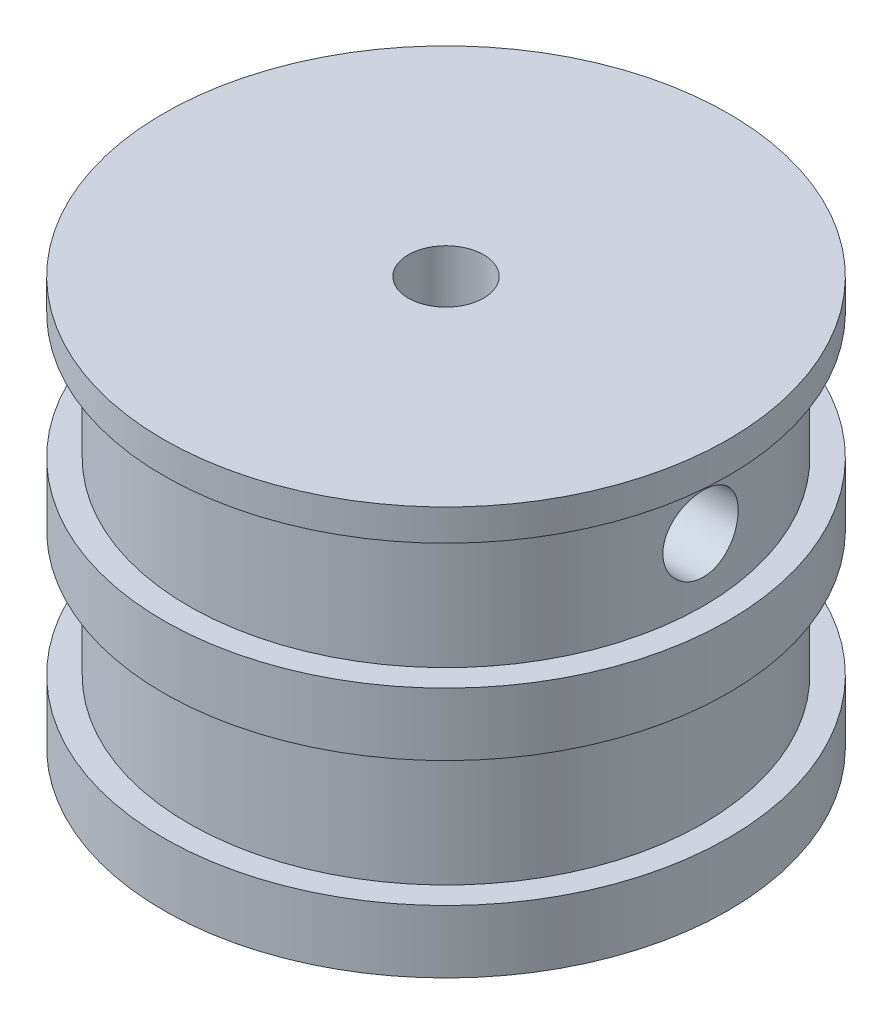
ISO-10303-21;
HEADER;
FILE_DESCRIPTION(('STEP AP214'),'2;1');
FILE_NAME('part.step','',(''),(''),'','','');
FILE_SCHEMA(('AUTOMOTIVE_DESIGN { 1 0 10303 214 1 1 1 1 }'));
ENDSEC;
DATA;
#1=APPLICATION_CONTEXT('core data for automotive mechanical design processes');
#2=APPLICATION_PROTOCOL_DEFINITION('international standard','automotive_design',2000,#1);
#3=PRODUCT_CONTEXT('',#1,'mechanical');
#4=PRODUCT('Part','Part','',(#3));
#5=PRODUCT_RELATED_PRODUCT_CATEGORY('part','',(#4));
#6=PRODUCT_DEFINITION_FORMATION('','',#4);
#7=PRODUCT_DEFINITION_CONTEXT('part definition',#1,'design');
#8=PRODUCT_DEFINITION('design','',#6,#7);
#9=PRODUCT_DEFINITION_SHAPE('','',#8);
#10=(LENGTH_UNIT() NAMED_UNIT(*) SI_UNIT(.MILLI.,.METRE.));
#11=(NAMED_UNIT(*) PLANE_ANGLE_UNIT() SI_UNIT($,.RADIAN.));
#12=(NAMED_UNIT(*) SI_UNIT($,.STERADIAN.) SOLID_ANGLE_UNIT());
#13=UNCERTAINTY_MEASURE_WITH_UNIT(LENGTH_MEASURE(1.E-05),#10,'distance_accuracy_value','');
#14=(GEOMETRIC_REPRESENTATION_CONTEXT(3) GLOBAL_UNCERTAINTY_ASSIGNED_CONTEXT((#13)) GLOBAL_UNIT_ASSIGNED_CONTEXT((#10,
#11,#12)) REPRESENTATION_CONTEXT('',''));
#15=CARTESIAN_POINT('',(0.,0.,0.));
#16=DIRECTION('',(0.,0.,1.));
#17=DIRECTION('',(1.,0.,0.));
#18=AXIS2_PLACEMENT_3D('',#15,#16,#17);
#19=CARTESIAN_POINT('',(-22.5000000000009,52.5000000000004,0.));
#20=DIRECTION('',(1.,0.,0.));
#21=DIRECTION('',(0.,0.,-1.));
#22=AXIS2_PLACEMENT_3D('',#19,#20,#21);
#23=CYLINDRICAL_SURFACE('',#22,3.);
#24=CARTESIAN_POINT('',(20.4999999999986,55.5000000000005,0.));
#25=CARTESIAN_POINT('',(20.4999973607971,55.4999930544588,0.167551274112497));
#26=CARTESIAN_POINT('',(20.4979242926422,55.4859159066347,0.335200951525567));
#27=CARTESIAN_POINT('',(20.4898539115536,55.4299916360493,0.665817543816577));
#28=CARTESIAN_POINT('',(20.4838527341256,55.3881171655627,0.828779682077471));
#29=CARTESIAN_POINT('',(20.4686007945359,55.2778734840935,1.1451883993056));
#30=CARTESIAN_POINT('',(20.4593524469519,55.2095239559297,1.29864194932962));
#31=CARTESIAN_POINT('',(20.4386291513202,55.0483176943781,1.59187723915038));
#32=CARTESIAN_POINT('',(20.4271545239256,54.9554644895839,1.7316609434717));
#33=CARTESIAN_POINT('',(20.403159893681,54.7471491999736,1.99465435493976));
#34=CARTESIAN_POINT('',(20.3906334371134,54.6315406470556,2.11774746913732));
#35=CARTESIAN_POINT('',(20.365997707354,54.381311483183,2.34285986406966));
#36=CARTESIAN_POINT('',(20.3538884577364,54.2466898000788,2.44487795558532));
#37=CARTESIAN_POINT('',(20.3313954798353,53.9614762186892,2.62539534957976));
#38=CARTESIAN_POINT('',(20.3210200899975,53.8108125460588,2.70378237917224));
#39=CARTESIAN_POINT('',(20.3032572917845,53.4982809463103,2.83409512433932));
#40=CARTESIAN_POINT('',(20.2958697284671,53.3364136007001,2.88602221210449));
#41=CARTESIAN_POINT('',(20.284982245701,53.0072934187189,2.96158010934644));
#42=CARTESIAN_POINT('',(20.2814549679223,52.8400872402256,2.9854101406846));
#43=CARTESIAN_POINT('',(20.2786042824561,52.504014961867,3.00471453872235));
#44=CARTESIAN_POINT('',(20.2792806448578,52.3351489532876,3.00019045620103));
#45=CARTESIAN_POINT('',(20.2847357969596,52.0019548276827,2.96307796924888));
#46=CARTESIAN_POINT('',(20.2894822073272,51.8376014330495,2.93071106241699));
#47=CARTESIAN_POINT('',(20.3024920891423,51.5166837553782,2.83917825706707));
#48=CARTESIAN_POINT('',(20.3107556556858,51.3601196830738,2.78001163394208));
#49=CARTESIAN_POINT('',(20.3299046732823,51.0585487802047,2.63632734168323));
#50=CARTESIAN_POINT('',(20.3407998368402,50.9135874742907,2.5517154708059));
#51=CARTESIAN_POINT('',(20.3639773484027,50.6398365894477,2.35960963714994));
#52=CARTESIAN_POINT('',(20.3762597831026,50.5110480222713,2.25211424393063));
#53=CARTESIAN_POINT('',(20.4009711243679,50.2720144235189,2.01607508554962));
#54=CARTESIAN_POINT('',(20.4134003127538,50.1619574613917,1.88734080638919));
#55=CARTESIAN_POINT('',(20.43689606846,49.9649824710016,1.61312853035604));
#56=CARTESIAN_POINT('',(20.4479626303215,49.8780645354338,1.46765046641094));
#57=CARTESIAN_POINT('',(20.4674969996132,49.729826715799,1.16392002425276));
#58=CARTESIAN_POINT('',(20.4759633769796,49.6685209113796,1.00566067672941));
#59=CARTESIAN_POINT('',(20.4893313588076,49.5734088577626,0.68094159323453));
#60=CARTESIAN_POINT('',(20.4942331925442,49.539600839863,0.514482385421752));
#61=CARTESIAN_POINT('',(20.4998895085718,49.5006931289914,0.179712382685182));
#62=CARTESIAN_POINT('',(20.5006813535041,49.4953347983961,0.0114322549735349));
#63=CARTESIAN_POINT('',(20.4981300472779,49.5127926831771,-0.323624059788038));
#64=CARTESIAN_POINT('',(20.4947870177863,49.5356080695539,-0.490400290944024));
#65=CARTESIAN_POINT('',(20.4843647103444,49.6085506989967,-0.816934415549132));
#66=CARTESIAN_POINT('',(20.4773026170258,49.658552356989,-0.976720958248136));
#67=CARTESIAN_POINT('',(20.4602316494574,49.7843160256686,-1.28564244930156));
#68=CARTESIAN_POINT('',(20.4502226426372,49.8600791952922,-1.43477691808455));
#69=CARTESIAN_POINT('',(20.4282777447206,50.035825007349,-1.71930098754809));
#70=CARTESIAN_POINT('',(20.4163289522248,50.1359722250388,-1.85458791963713));
#71=CARTESIAN_POINT('',(20.3918757523167,50.3574136143591,-2.10652667196152));
#72=CARTESIAN_POINT('',(20.3793713142775,50.4787089527425,-2.22317746335059));
#73=CARTESIAN_POINT('',(20.3550981721652,50.7401530112004,-2.43547007233668));
#74=CARTESIAN_POINT('',(20.3433360538285,50.8804429765506,-2.53093880939075));
#75=CARTESIAN_POINT('',(20.3219946608972,51.17521972797,-2.69695540248555));
#76=CARTESIAN_POINT('',(20.3124153295892,51.3297061450389,-2.76750390603306));
#77=CARTESIAN_POINT('',(20.2965713903983,51.6479677463096,-2.88140726833885));
#78=CARTESIAN_POINT('',(20.2902955674517,51.8117093854329,-2.9248542281834));
#79=CARTESIAN_POINT('',(20.2817390414568,52.1442636784943,-2.98361492696057));
#80=CARTESIAN_POINT('',(20.2794580769339,52.3130759998065,-2.99893050717303));
#81=CARTESIAN_POINT('',(20.2791589660791,52.649255114378,-3.00095145966441));
#82=CARTESIAN_POINT('',(20.2811002782945,52.8166202996279,-2.98792892817569));
#83=CARTESIAN_POINT('',(20.288939025127,53.1467534747823,-2.93422532266822));
#84=CARTESIAN_POINT('',(20.2948364545988,53.3095214706654,-2.89354428462109));
#85=CARTESIAN_POINT('',(20.3099090269137,53.6257706508424,-2.78577296430281));
#86=CARTESIAN_POINT('',(20.3190819228671,53.7792581171616,-2.71870078250079));
#87=CARTESIAN_POINT('',(20.3396747456542,54.0728452808866,-2.56007807316655));
#88=CARTESIAN_POINT('',(20.3510947411507,54.2129445690053,-2.46852679761386));
#89=CARTESIAN_POINT('',(20.3750257118914,54.4771623600463,-2.26255269742272));
#90=CARTESIAN_POINT('',(20.3875457198717,54.6011227751178,-2.1479281096326));
#91=CARTESIAN_POINT('',(20.4121899227908,54.8281467500436,-1.89948729697266));
#92=CARTESIAN_POINT('',(20.4243140248746,54.931205436761,-1.76566660901242));
#93=CARTESIAN_POINT('',(20.4468724483858,55.1139788232115,-1.48181189622495));
#94=CARTESIAN_POINT('',(20.4572976074895,55.1935687071451,-1.33169679196189));
#95=CARTESIAN_POINT('',(20.4751933643112,55.3262879066024,-1.02014994145281));
#96=CARTESIAN_POINT('',(20.4826670442254,55.3794448408755,-0.858730209076419));
#97=CARTESIAN_POINT('',(20.4920965960281,55.4456243806654,-0.580473421119607));
#98=CARTESIAN_POINT('',(20.4950452757186,55.4659843726089,-0.465360266997957));
#99=CARTESIAN_POINT('',(20.4989978862223,55.4931745246563,-0.233513997205091));
#100=CARTESIAN_POINT('',(20.5000018394853,55.5000048409461,-0.116780900250098));
#101=CARTESIAN_POINT('',(20.4999999999986,55.5000000000005,0.));
#102=B_SPLINE_CURVE_WITH_KNOTS('',3,(#24,#25,#26,#27,#28,#29,#30,#31,#32,#33,#34,#35,#36,#37,
#38,#39,#40,#41,#42,#43,#44,#45,#46,#47,#48,#49,#50,#51,#52,#53,#54,#55,#56,#57,#58,#59,#60,#61,
#62,#63,#64,#65,#66,#67,#68,#69,#70,#71,#72,#73,#74,#75,#76,#77,#78,#79,#80,#81,#82,#83,#84,#85,
#86,#87,#88,#89,#90,#91,#92,#93,#94,#95,#96,#97,#98,#99,#100,#101),.UNSPECIFIED.,.T.,.F.,(4,2,2,
2,2,2,2,2,2,2,2,2,2,2,2,2,2,2,2,2,2,2,2,2,2,2,2,2,2,2,2,2,2,2,2,2,2,2,4),(0.,0.502227119214347,
1.00494907620881,1.50729800088738,2.00957462543936,2.5151966830633,3.02084726408613,
3.52886368058522,4.03685374909387,4.54121983512863,5.04555833597567,5.54592139785699,
6.04629798929193,6.5485503370542,7.05083408965239,7.55789630191072,8.06496054543308,
8.57230316959597,9.07961315808518,9.58230316735355,10.0849783855378,10.5853510190587,
11.0857461658821,11.5896171035691,12.0935158488768,12.6013916339521,13.1092542218314,
13.6153813649429,14.1214753793941,14.6227314497871,15.1239868682663,15.6248990963324,
16.125826632785,16.6313412811106,17.136973652589,17.6452485723026,18.1529912937422,
18.5030406293488,18.8530859239759),.UNSPECIFIED.);
#103=CARTESIAN_POINT('',(20.4999999999986,55.5000000000005,0.));
#104=VERTEX_POINT('',#103);
#105=EDGE_CURVE('E74',#104,#104,#102,.T.);
#106=ORIENTED_EDGE('',*,*,#105,.T.);
#107=EDGE_LOOP('',(#106));
#108=FACE_BOUND('',#107,.T.);
#109=CARTESIAN_POINT('',(0.,52.5000000000004,0.));
#110=DIRECTION('',(0.707106781186547,-0.707106781186547,0.));
#111=DIRECTION('',(0.707106781186547,0.707106781186547,0.));
#112=AXIS2_PLACEMENT_3D('',#109,#110,#111);
#113=ELLIPSE('',#112,4.24264068711929,3.);
#114=CARTESIAN_POINT('',(0.,52.5000000000004,3.));
#115=VERTEX_POINT('',#114);
#116=CARTESIAN_POINT('',(0.,52.5000000000004,-3.));
#117=VERTEX_POINT('',#116);
#118=EDGE_CURVE('E53',#115,#117,#113,.F.);
#119=ORIENTED_EDGE('',*,*,#118,.T.);
#120=CARTESIAN_POINT('',(0.,52.5000000000004,0.));
#121=DIRECTION('',(0.707106781186547,0.707106781186547,0.));
#122=DIRECTION('',(0.707106781186547,-0.707106781186547,0.));
#123=AXIS2_PLACEMENT_3D('',#120,#121,#122);
#124=ELLIPSE('',#123,4.24264068711929,3.);
#125=EDGE_CURVE('E11',#117,#115,#124,.F.);
#126=ORIENTED_EDGE('',*,*,#125,.T.);
#127=EDGE_LOOP('',(#119,#126));
#128=FACE_BOUND('',#127,.T.);
#129=ADVANCED_FACE('F39',(#108,#128),#23,.F.);
#130=CARTESIAN_POINT('',(0.,60.,0.));
#131=DIRECTION('',(0.,-1.,0.));
#132=DIRECTION('',(0.,0.,-1.));
#133=AXIS2_PLACEMENT_3D('',#130,#131,#132);
#134=CYLINDRICAL_SURFACE('',#133,22.5);
#135=CARTESIAN_POINT('',(-1.196959198424E-12,57.5000000000005,0.));
#136=DIRECTION('',(0.,-1.,0.));
#137=DIRECTION('',(1.,0.,0.));
#138=AXIS2_PLACEMENT_3D('',#135,#136,#137);
#139=CIRCLE('',#138,22.4999999999997);
#140=CARTESIAN_POINT('',(22.4999999999985,57.5000000000009,0.));
#141=VERTEX_POINT('',#140);
#142=EDGE_CURVE('E135',#141,#141,#139,.T.);
#143=ORIENTED_EDGE('',*,*,#142,.F.);
#144=EDGE_LOOP('',(#143));
#145=FACE_BOUND('',#144,.T.);
#146=CARTESIAN_POINT('',(0.,60.,0.));
#147=DIRECTION('',(0.,1.,0.));
#148=DIRECTION('',(0.,0.,1.));
#149=AXIS2_PLACEMENT_3D('',#146,#147,#148);
#150=CIRCLE('',#149,22.5);
#151=CARTESIAN_POINT('',(0.,60.,22.5));
#152=VERTEX_POINT('',#151);
#153=EDGE_CURVE('E68',#152,#152,#150,.T.);
#154=ORIENTED_EDGE('',*,*,#153,.F.);
#155=EDGE_LOOP('',(#154));
#156=FACE_BOUND('',#155,.T.);
#157=ADVANCED_FACE('F41',(#145,#156),#134,.T.);
#158=CARTESIAN_POINT('',(0.,60.,0.));
#159=DIRECTION('',(0.,1.,0.));
#160=DIRECTION('',(0.,0.,1.));
#161=AXIS2_PLACEMENT_3D('',#158,#159,#160);
#162=PLANE('',#161);
#163=CARTESIAN_POINT('',(0.,60.,0.));
#164=DIRECTION('',(0.,1.,0.));
#165=DIRECTION('',(0.,0.,1.));
#166=AXIS2_PLACEMENT_3D('',#163,#164,#165);
#167=CIRCLE('',#166,3.);
#168=CARTESIAN_POINT('',(0.,60.,3.));
#169=VERTEX_POINT('',#168);
#170=EDGE_CURVE('E304',#169,#169,#167,.T.);
#171=ORIENTED_EDGE('',*,*,#170,.F.);
#172=EDGE_LOOP('',(#171));
#173=FACE_BOUND('',#172,.T.);
#174=ORIENTED_EDGE('',*,*,#153,.T.);
#175=EDGE_LOOP('',(#174));
#176=FACE_BOUND('',#175,.T.);
#177=ADVANCED_FACE('F109',(#173,#176),#162,.T.);
#178=CARTESIAN_POINT('',(-7.97972798949342E-13,57.5000000000005,0.));
#179=DIRECTION('',(0.,1.,0.));
#180=DIRECTION('',(-1.,0.,0.));
#181=AXIS2_PLACEMENT_3D('',#178,#179,#180);
#182=PLANE('',#181);
#183=CARTESIAN_POINT('',(-1.196959198424E-12,57.5000000000005,0.));
#184=DIRECTION('',(0.,-1.,0.));
#185=DIRECTION('',(1.,0.,0.));
#186=AXIS2_PLACEMENT_3D('',#183,#184,#185);
#187=CIRCLE('',#186,20.4999999999997);
#188=CARTESIAN_POINT('',(20.4999999999985,57.5000000000009,0.));
#189=VERTEX_POINT('',#188);
#190=EDGE_CURVE('E124',#189,#189,#187,.T.);
#191=ORIENTED_EDGE('',*,*,#190,.F.);
#192=EDGE_LOOP('',(#191));
#193=FACE_BOUND('',#192,.T.);
#194=ORIENTED_EDGE('',*,*,#142,.T.);
#195=EDGE_LOOP('',(#194));
#196=FACE_BOUND('',#195,.T.);
#197=ADVANCED_FACE('F167',(#193,#196),#182,.F.);
#198=CARTESIAN_POINT('',(-4.94396190653399E-13,47.5000000000005,0.));
#199=DIRECTION('',(0.,1.,0.));
#200=DIRECTION('',(-1.,0.,0.));
#201=AXIS2_PLACEMENT_3D('',#198,#199,#200);
#202=PLANE('',#201);
#203=CARTESIAN_POINT('',(-9.88792381306785E-13,47.5000000000004,0.));
#204=DIRECTION('',(0.,-1.,0.));
#205=DIRECTION('',(1.,0.,0.));
#206=AXIS2_PLACEMENT_3D('',#203,#204,#205);
#207=CIRCLE('',#206,20.4999999999998);
#208=CARTESIAN_POINT('',(20.4999999999988,47.5000000000009,0.));
#209=VERTEX_POINT('',#208);
#210=EDGE_CURVE('E127',#209,#209,#207,.T.);
#211=ORIENTED_EDGE('',*,*,#210,.T.);
#212=EDGE_LOOP('',(#211));
#213=FACE_BOUND('',#212,.T.);
#214=CARTESIAN_POINT('',(-9.88792381306786E-13,47.5000000000005,0.));
#215=DIRECTION('',(0.,-1.,0.));
#216=DIRECTION('',(1.,0.,0.));
#217=AXIS2_PLACEMENT_3D('',#214,#215,#216);
#218=CIRCLE('',#217,22.4999999999998);
#219=CARTESIAN_POINT('',(22.4999999999988,47.5000000000009,0.));
#220=VERTEX_POINT('',#219);
#221=EDGE_CURVE('E130',#220,#220,#218,.T.);
#222=ORIENTED_EDGE('',*,*,#221,.F.);
#223=EDGE_LOOP('',(#222));
#224=FACE_BOUND('',#223,.T.);
#225=ADVANCED_FACE('F117',(#213,#224),#202,.T.);
#226=CARTESIAN_POINT('',(0.,0.,0.));
#227=DIRECTION('',(0.,-1.,0.));
#228=DIRECTION('',(1.,0.,0.));
#229=AXIS2_PLACEMENT_3D('',#226,#227,#228);
#230=CYLINDRICAL_SURFACE('',#229,20.4999999999998);
#231=ORIENTED_EDGE('',*,*,#105,.F.);
#232=EDGE_LOOP('',(#231));
#233=FACE_BOUND('',#232,.T.);
#234=CARTESIAN_POINT('',(-20.2792997906741,52.5000000000004,-3.));
#235=CARTESIAN_POINT('',(-20.2793025374249,52.3324595555566,-2.9999930451477));
#236=CARTESIAN_POINT('',(-20.2813984893178,52.1648206782778,-2.98591765559669));
#237=CARTESIAN_POINT('',(-20.2895505551082,51.8342265214094,-2.93000100285925));
#238=CARTESIAN_POINT('',(-20.2956105749968,51.6712760270192,-2.88813235300425));
#239=CARTESIAN_POINT('',(-20.3109900322092,51.3548919454942,-2.77790569452807));
#240=CARTESIAN_POINT('',(-20.3203070132379,51.2014512887273,-2.70956764409246));
#241=CARTESIAN_POINT('',(-20.3411476830147,50.9082376551019,-2.54838842240747));
#242=CARTESIAN_POINT('',(-20.3526710564038,50.7684627293122,-2.45555075216513));
#243=CARTESIAN_POINT('',(-20.3767243901964,50.5054596226084,-2.24725124602923));
#244=CARTESIAN_POINT('',(-20.3892606782698,50.3823507640883,-2.13163946345857));
#245=CARTESIAN_POINT('',(-20.4138707793482,50.1572079200838,-1.88139720074456));
#246=CARTESIAN_POINT('',(-20.4259445672891,50.0551750754577,-1.74676569171496));
#247=CARTESIAN_POINT('',(-20.4483352874299,49.8746420806121,-1.4615432855519));
#248=CARTESIAN_POINT('',(-20.4586439435692,49.7962515411568,-1.31088230466998));
#249=CARTESIAN_POINT('',(-20.4762728870684,49.6659315674554,-0.998356547815582));
#250=CARTESIAN_POINT('',(-20.4835933248805,49.6140008009689,-0.836492336388062));
#251=CARTESIAN_POINT('',(-20.4943763862813,49.5384354721371,-0.507382631213983));
#252=CARTESIAN_POINT('',(-20.4978662144792,49.514601279972,-0.340183879263832));
#253=CARTESIAN_POINT('',(-20.5006880352203,49.4952859861411,-0.00412620717143882));
#254=CARTESIAN_POINT('',(-20.5000202482851,49.4998033806951,0.164732624445155));
#255=CARTESIAN_POINT('',(-20.4946238594462,49.5369051042037,0.497955774785673));
#256=CARTESIAN_POINT('',(-20.4899263302952,49.5692746748762,0.662344579666539));
#257=CARTESIAN_POINT('',(-20.4770329125101,49.6608250142455,0.983331695494815));
#258=CARTESIAN_POINT('',(-20.4688369373911,49.7200064457586,1.13992981374236));
#259=CARTESIAN_POINT('',(-20.4498140707837,49.8637217532158,1.44154266345555));
#260=CARTESIAN_POINT('',(-20.4389777828711,49.9483464347624,1.58651351027327));
#261=CARTESIAN_POINT('',(-20.4158827327488,50.1404798015049,1.86027807943482));
#262=CARTESIAN_POINT('',(-20.4036238813759,50.247989921465,1.98907078671201));
#263=CARTESIAN_POINT('',(-20.3789161345984,50.4840397485025,2.2280884080107));
#264=CARTESIAN_POINT('',(-20.366466534447,50.6127669083558,2.33812820566431));
#265=CARTESIAN_POINT('',(-20.3428925923074,50.886958746885,2.53507192478547));
#266=CARTESIAN_POINT('',(-20.3317682577531,51.0324235194382,2.62197571647963));
#267=CARTESIAN_POINT('',(-20.3121046612565,51.3361499047381,2.77020326673648));
#268=CARTESIAN_POINT('',(-20.3035672564175,51.494420607813,2.83150866061675));
#269=CARTESIAN_POINT('',(-20.2900775102157,51.8191644408267,2.9266164346217));
#270=CARTESIAN_POINT('',(-20.2851249289539,51.9856370210934,2.96042065516435));
#271=CARTESIAN_POINT('',(-20.2794108473386,52.32041395821,2.99931400125128));
#272=CARTESIAN_POINT('',(-20.2786110918468,52.4886872333925,3.00466524192489));
#273=CARTESIAN_POINT('',(-20.2811917114474,52.8237281574074,2.98719562292122));
#274=CARTESIAN_POINT('',(-20.284571963294,52.9904958504854,2.96437559386258));
#275=CARTESIAN_POINT('',(-20.2950966249532,53.3169838367997,2.8914332717428));
#276=CARTESIAN_POINT('',(-20.3022231051744,53.4767338044523,2.84144098775254));
#277=CARTESIAN_POINT('',(-20.319422506211,53.7855862754558,2.71570826850896));
#278=CARTESIAN_POINT('',(-20.3294955660604,53.9346882759707,2.63996661824804));
#279=CARTESIAN_POINT('',(-20.3515435160627,54.2191890606518,2.46425312413682));
#280=CARTESIAN_POINT('',(-20.3635315387173,54.3544817993608,2.36411125627528));
#281=CARTESIAN_POINT('',(-20.3880188599861,54.6064347467902,2.14267696980532));
#282=CARTESIAN_POINT('',(-20.4005181860474,54.7230939535983,2.02138341461787));
#283=CARTESIAN_POINT('',(-20.4247390023745,54.9354064139614,1.75993593738027));
#284=CARTESIAN_POINT('',(-20.4364535569195,55.0308861883164,1.61964040191008));
#285=CARTESIAN_POINT('',(-20.457677804133,55.1969221253421,1.32484940717094));
#286=CARTESIAN_POINT('',(-20.4671875547288,55.2674789428436,1.17035432111821));
#287=CARTESIAN_POINT('',(-20.4829002564539,55.3813874603385,0.852096847895966));
#288=CARTESIAN_POINT('',(-20.4891148279205,55.424834857928,0.688369310015701));
#289=CARTESIAN_POINT('',(-20.4975856577859,55.4836012043028,0.355844891686859));
#290=CARTESIAN_POINT('',(-20.4998421644781,55.4989219175064,0.187048329899015));
#291=CARTESIAN_POINT('',(-20.5001403382026,55.5009585207821,-0.149138318359184));
#292=CARTESIAN_POINT('',(-20.4982211633606,55.4879401644682,-0.316526821106137));
#293=CARTESIAN_POINT('',(-20.4904623875661,55.4342367356885,-0.646707710701838));
#294=CARTESIAN_POINT('',(-20.4846227974223,55.3935517394995,-0.809500110220745));
#295=CARTESIAN_POINT('',(-20.4696762551726,55.2857625603777,-1.12580066539818));
#296=CARTESIAN_POINT('',(-20.4605714706756,55.2186759013955,-1.27931490157632));
#297=CARTESIAN_POINT('',(-20.4400958485142,55.0600159008027,-1.57294961238444));
#298=CARTESIAN_POINT('',(-20.428724944449,54.9684418416456,-1.71306969436639));
#299=CARTESIAN_POINT('',(-20.4048551135872,54.7624418679594,-1.9772882211517));
#300=CARTESIAN_POINT('',(-20.3923470317422,54.6478194509205,-2.10123264758933));
#301=CARTESIAN_POINT('',(-20.3676812025677,54.3993896669269,-2.32822537305069));
#302=CARTESIAN_POINT('',(-20.3555235382336,54.2655777991253,-2.43126875604844));
#303=CARTESIAN_POINT('',(-20.3328656465546,53.9817310586409,-2.61402470169434));
#304=CARTESIAN_POINT('',(-20.32237460167,53.8316134944876,-2.69360994359625));
#305=CARTESIAN_POINT('',(-20.3043453693686,53.5200616081924,-2.82631979377878));
#306=CARTESIAN_POINT('',(-20.2968040960161,53.358639322252,-2.87947207108455));
#307=CARTESIAN_POINT('',(-20.2872846705125,53.0803948341722,-2.94563919196652));
#308=CARTESIAN_POINT('',(-20.284306062306,52.9652973958654,-2.96599360507699));
#309=CARTESIAN_POINT('',(-20.280312677028,52.7334825623705,-2.99317635138331));
#310=CARTESIAN_POINT('',(-20.279297876361,52.6167651866632,-3.00000484709606));
#311=CARTESIAN_POINT('',(-20.2792997906741,52.5000000000004,-3.));
#312=B_SPLINE_CURVE_WITH_KNOTS('',3,(#234,#235,#236,#237,#238,#239,#240,#241,#242,#243,#244,
#245,#246,#247,#248,#249,#250,#251,#252,#253,#254,#255,#256,#257,#258,#259,#260,#261,#262,#263,
#264,#265,#266,#267,#268,#269,#270,#271,#272,#273,#274,#275,#276,#277,#278,#279,#280,#281,#282,
#283,#284,#285,#286,#287,#288,#289,#290,#291,#292,#293,#294,#295,#296,#297,#298,#299,#300,#301,
#302,#303,#304,#305,#306,#307,#308,#309,#310,#311),.UNSPECIFIED.,.T.,.F.,(4,2,2,2,2,2,2,2,2,2,2,
2,2,2,2,2,2,2,2,2,2,2,2,2,2,2,2,2,2,2,2,2,2,2,2,2,2,2,4),(0.,0.502194580870726,1.00488474565248,
1.50719661270946,2.0094367380002,2.5151013877544,3.02079340229577,3.52879509416412,
4.03677120579611,4.54111590046983,5.04543384471399,5.54589766660697,6.04637386114647,
6.5486578698005,7.05097337758555,7.55799147665511,8.06501241960656,8.57239648476493,
9.07974659226004,9.58241467674425,10.0850679406146,10.5853371004693,11.0856298692629,
11.5895137864723,12.0934247880679,12.6013222320974,13.109206330536,13.6152872764613,
14.1213364742786,14.6226605829159,15.1239833094092,15.6249738455433,16.1259790636539,
16.6314520719235,17.137043832366,17.6453312273109,18.1530854404514,18.5030877861088,
18.8530859263849),.UNSPECIFIED.);
#313=CARTESIAN_POINT('',(-20.2792997906741,52.5000000000004,-3.));
#314=VERTEX_POINT('',#313);
#315=EDGE_CURVE('E84',#314,#314,#312,.T.);
#316=ORIENTED_EDGE('',*,*,#315,.F.);
#317=EDGE_LOOP('',(#316));
#318=FACE_BOUND('',#317,.T.);
#319=ORIENTED_EDGE('',*,*,#190,.T.);
#320=EDGE_LOOP('',(#319));
#321=FACE_BOUND('',#320,.T.);
#322=ORIENTED_EDGE('',*,*,#210,.F.);
#323=EDGE_LOOP('',(#322));
#324=FACE_BOUND('',#323,.T.);
#325=ADVANCED_FACE('F89',(#233,#318,#321,#324),#230,.T.);
#326=CARTESIAN_POINT('',(-8.84708972748178E-13,42.5000000000005,0.));
#327=DIRECTION('',(0.,-1.,0.));
#328=DIRECTION('',(1.,0.,0.));
#329=AXIS2_PLACEMENT_3D('',#326,#327,#328);
#330=CIRCLE('',#329,22.4999999999999);
#331=CARTESIAN_POINT('',(22.499999999999,42.5000000000009,0.));
#332=VERTEX_POINT('',#331);
#333=EDGE_CURVE('E137',#332,#332,#330,.T.);
#334=ORIENTED_EDGE('',*,*,#333,.F.);
#335=EDGE_LOOP('',(#334));
#336=FACE_BOUND('',#335,.T.);
#337=ORIENTED_EDGE('',*,*,#221,.T.);
#338=EDGE_LOOP('',(#337));
#339=FACE_BOUND('',#338,.T.);
#340=ADVANCED_FACE('F111',(#336,#339),#134,.T.);
#341=CARTESIAN_POINT('',(-5.89805981832124E-13,42.5000000000005,0.));
#342=DIRECTION('',(0.,1.,0.));
#343=DIRECTION('',(-1.,0.,0.));
#344=AXIS2_PLACEMENT_3D('',#341,#342,#343);
#345=PLANE('',#344);
#346=CARTESIAN_POINT('',(-8.84708972748178E-13,42.5000000000005,0.));
#347=DIRECTION('',(0.,-1.,0.));
#348=DIRECTION('',(1.,0.,0.));
#349=AXIS2_PLACEMENT_3D('',#346,#347,#348);
#350=CIRCLE('',#349,20.4999999999999);
#351=CARTESIAN_POINT('',(20.499999999999,42.5000000000009,0.));
#352=VERTEX_POINT('',#351);
#353=EDGE_CURVE('E144',#352,#352,#350,.T.);
#354=ORIENTED_EDGE('',*,*,#353,.F.);
#355=EDGE_LOOP('',(#354));
#356=FACE_BOUND('',#355,.T.);
#357=ORIENTED_EDGE('',*,*,#333,.T.);
#358=EDGE_LOOP('',(#357));
#359=FACE_BOUND('',#358,.T.);
#360=ADVANCED_FACE('F179',(#356,#359),#345,.F.);
#361=CARTESIAN_POINT('',(-4.51028103753979E-13,32.5000000000005,0.));
#362=DIRECTION('',(0.,1.,0.));
#363=DIRECTION('',(-1.,0.,0.));
#364=AXIS2_PLACEMENT_3D('',#361,#362,#363);
#365=PLANE('',#364);
#366=CARTESIAN_POINT('',(-6.76542155630962E-13,32.5000000000005,0.));
#367=DIRECTION('',(0.,-1.,0.));
#368=DIRECTION('',(1.,0.,0.));
#369=AXIS2_PLACEMENT_3D('',#366,#367,#368);
#370=CIRCLE('',#369,20.5);
#371=CARTESIAN_POINT('',(20.4999999999993,32.5000000000009,0.));
#372=VERTEX_POINT('',#371);
#373=EDGE_CURVE('E148',#372,#372,#370,.T.);
#374=ORIENTED_EDGE('',*,*,#373,.T.);
#375=EDGE_LOOP('',(#374));
#376=FACE_BOUND('',#375,.T.);
#377=CARTESIAN_POINT('',(-6.76542155630962E-13,32.5000000000005,0.));
#378=DIRECTION('',(0.,-1.,0.));
#379=DIRECTION('',(1.,0.,0.));
#380=AXIS2_PLACEMENT_3D('',#377,#378,#379);
#381=CIRCLE('',#380,22.5);
#382=CARTESIAN_POINT('',(22.4999999999993,32.5000000000009,0.));
#383=VERTEX_POINT('',#382);
#384=EDGE_CURVE('E152',#383,#383,#381,.T.);
#385=ORIENTED_EDGE('',*,*,#384,.F.);
#386=EDGE_LOOP('',(#385));
#387=FACE_BOUND('',#386,.T.);
#388=ADVANCED_FACE('F182',(#376,#387),#365,.T.);
#389=CARTESIAN_POINT('',(0.,0.,0.));
#390=DIRECTION('',(0.,-1.,0.));
#391=DIRECTION('',(1.,0.,0.));
#392=AXIS2_PLACEMENT_3D('',#389,#390,#391);
#393=CYLINDRICAL_SURFACE('',#392,20.4999999999999);
#394=ORIENTED_EDGE('',*,*,#353,.T.);
#395=EDGE_LOOP('',(#394));
#396=FACE_BOUND('',#395,.T.);
#397=ORIENTED_EDGE('',*,*,#373,.F.);
#398=EDGE_LOOP('',(#397));
#399=FACE_BOUND('',#398,.T.);
#400=ADVANCED_FACE('F186',(#396,#399),#393,.T.);
#401=CARTESIAN_POINT('',(-5.72458747072354E-13,27.5000000000005,0.));
#402=DIRECTION('',(0.,-1.,0.));
#403=DIRECTION('',(1.,0.,0.));
#404=AXIS2_PLACEMENT_3D('',#401,#402,#403);
#405=CIRCLE('',#404,22.5);
#406=CARTESIAN_POINT('',(22.4999999999995,27.5000000000009,0.));
#407=VERTEX_POINT('',#406);
#408=EDGE_CURVE('E83',#407,#407,#405,.T.);
#409=ORIENTED_EDGE('',*,*,#408,.F.);
#410=EDGE_LOOP('',(#409));
#411=FACE_BOUND('',#410,.T.);
#412=ORIENTED_EDGE('',*,*,#384,.T.);
#413=EDGE_LOOP('',(#412));
#414=FACE_BOUND('',#413,.T.);
#415=ADVANCED_FACE('F112',(#411,#414),#134,.T.);
#416=CARTESIAN_POINT('',(-3.81639164714907E-13,27.5000000000005,0.));
#417=DIRECTION('',(0.,1.,0.));
#418=DIRECTION('',(-1.,0.,0.));
#419=AXIS2_PLACEMENT_3D('',#416,#417,#418);
#420=PLANE('',#419);
#421=CARTESIAN_POINT('',(0.,27.5,0.));
#422=DIRECTION('',(0.,1.,0.));
#423=DIRECTION('',(0.,0.,1.));
#424=AXIS2_PLACEMENT_3D('',#421,#422,#423);
#425=CIRCLE('',#424,3.);
#426=CARTESIAN_POINT('',(0.,27.5,3.));
#427=VERTEX_POINT('',#426);
#428=EDGE_CURVE('E302',#427,#427,#425,.T.);
#429=ORIENTED_EDGE('',*,*,#428,.T.);
#430=EDGE_LOOP('',(#429));
#431=FACE_BOUND('',#430,.T.);
#432=ORIENTED_EDGE('',*,*,#408,.T.);
#433=EDGE_LOOP('',(#432));
#434=FACE_BOUND('',#433,.T.);
#435=ADVANCED_FACE('F95',(#431,#434),#420,.F.);
#436=CARTESIAN_POINT('',(0.,52.5000000000004,0.));
#437=DIRECTION('',(0.707106781186547,-0.707106781186547,0.));
#438=DIRECTION('',(0.707106781186547,0.707106781186547,0.));
#439=AXIS2_PLACEMENT_3D('',#436,#437,#438);
#440=ELLIPSE('',#439,4.24264068711929,3.);
#441=EDGE_CURVE('E59',#115,#117,#440,.T.);
#442=ORIENTED_EDGE('',*,*,#441,.T.);
#443=CARTESIAN_POINT('',(0.,52.5000000000004,0.));
#444=DIRECTION('',(0.707106781186547,0.707106781186547,0.));
#445=DIRECTION('',(0.707106781186547,-0.707106781186547,0.));
#446=AXIS2_PLACEMENT_3D('',#443,#444,#445);
#447=ELLIPSE('',#446,4.24264068711929,3.);
#448=EDGE_CURVE('E48',#117,#115,#447,.T.);
#449=ORIENTED_EDGE('',*,*,#448,.T.);
#450=EDGE_LOOP('',(#442,#449));
#451=FACE_BOUND('',#450,.T.);
#452=ORIENTED_EDGE('',*,*,#315,.T.);
#453=EDGE_LOOP('',(#452));
#454=FACE_BOUND('',#453,.T.);
#455=ADVANCED_FACE('F70',(#451,#454),#23,.F.);
#456=CARTESIAN_POINT('',(0.,27.5,0.));
#457=DIRECTION('',(0.,1.,0.));
#458=DIRECTION('',(0.,0.,1.));
#459=AXIS2_PLACEMENT_3D('',#456,#457,#458);
#460=CYLINDRICAL_SURFACE('',#459,3.);
#461=ORIENTED_EDGE('',*,*,#170,.T.);
#462=EDGE_LOOP('',(#461));
#463=FACE_BOUND('',#462,.T.);
#464=ORIENTED_EDGE('',*,*,#118,.F.);
#465=ORIENTED_EDGE('',*,*,#448,.F.);
#466=EDGE_LOOP('',(#464,#465));
#467=FACE_BOUND('',#466,.T.);
#468=ADVANCED_FACE('F66',(#463,#467),#460,.F.);
#469=ORIENTED_EDGE('',*,*,#428,.F.);
#470=EDGE_LOOP('',(#469));
#471=FACE_BOUND('',#470,.T.);
#472=ORIENTED_EDGE('',*,*,#441,.F.);
#473=ORIENTED_EDGE('',*,*,#125,.F.);
#474=EDGE_LOOP('',(#472,#473));
#475=FACE_BOUND('',#474,.T.);
#476=ADVANCED_FACE('F60',(#471,#475),#460,.F.);
#477=CLOSED_SHELL('',(#129,#157,#177,#197,#225,#325,#340,#360,#388,#400,#415,#435,#455,#468,#476));
#478=MANIFOLD_SOLID_BREP('B2',#477);
#479=ADVANCED_BREP_SHAPE_REPRESENTATION('',(#18,#478),#14);
#480=SHAPE_DEFINITION_REPRESENTATION(#9,#479);
ENDSEC;
END-ISO-10303-21;
